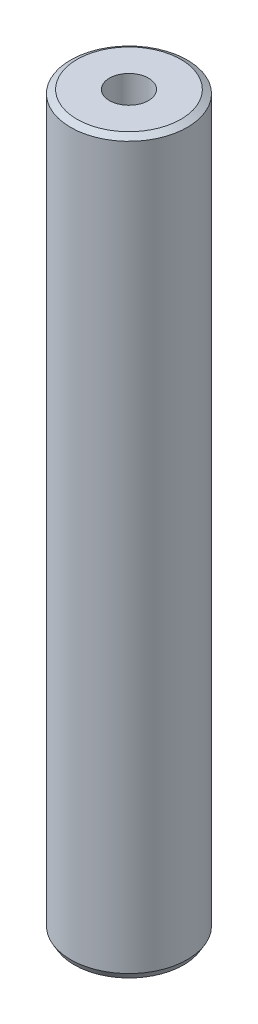
ISO-10303-21;
HEADER;
FILE_DESCRIPTION(('STEP AP214'),'2;1');
FILE_NAME('part.step','',(''),(''),'','','');
FILE_SCHEMA(('AUTOMOTIVE_DESIGN { 1 0 10303 214 1 1 1 1 }'));
ENDSEC;
DATA;
#1=APPLICATION_CONTEXT('core data for automotive mechanical design processes');
#2=APPLICATION_PROTOCOL_DEFINITION('international standard','automotive_design',2000,#1);
#3=PRODUCT_CONTEXT('',#1,'mechanical');
#4=PRODUCT('Part','Part','',(#3));
#5=PRODUCT_RELATED_PRODUCT_CATEGORY('part','',(#4));
#6=PRODUCT_DEFINITION_FORMATION('','',#4);
#7=PRODUCT_DEFINITION_CONTEXT('part definition',#1,'design');
#8=PRODUCT_DEFINITION('design','',#6,#7);
#9=PRODUCT_DEFINITION_SHAPE('','',#8);
#10=(LENGTH_UNIT() NAMED_UNIT(*) SI_UNIT(.MILLI.,.METRE.));
#11=(NAMED_UNIT(*) PLANE_ANGLE_UNIT() SI_UNIT($,.RADIAN.));
#12=(NAMED_UNIT(*) SI_UNIT($,.STERADIAN.) SOLID_ANGLE_UNIT());
#13=UNCERTAINTY_MEASURE_WITH_UNIT(LENGTH_MEASURE(1.E-05),#10,'distance_accuracy_value','');
#14=(GEOMETRIC_REPRESENTATION_CONTEXT(3) GLOBAL_UNCERTAINTY_ASSIGNED_CONTEXT((#13)) GLOBAL_UNIT_ASSIGNED_CONTEXT((#10,
#11,#12)) REPRESENTATION_CONTEXT('',''));
#15=CARTESIAN_POINT('',(0.,0.,0.));
#16=DIRECTION('',(0.,0.,1.));
#17=DIRECTION('',(1.,0.,0.));
#18=AXIS2_PLACEMENT_3D('',#15,#16,#17);
#19=CARTESIAN_POINT('',(0.,219.123057402879,0.));
#20=DIRECTION('',(0.,-1.,0.));
#21=DIRECTION('',(0.,0.,-1.));
#22=AXIS2_PLACEMENT_3D('',#19,#20,#21);
#23=CYLINDRICAL_SURFACE('',#22,17.5);
#24=CARTESIAN_POINT('',(0.,218.002614538572,0.));
#25=DIRECTION('',(0.,1.,0.));
#26=DIRECTION('',(0.,0.,1.));
#27=AXIS2_PLACEMENT_3D('',#24,#25,#26);
#28=CIRCLE('',#27,17.5);
#29=CARTESIAN_POINT('',(0.,218.002614538572,17.5));
#30=VERTEX_POINT('',#29);
#31=EDGE_CURVE('E50',#30,#30,#28,.F.);
#32=ORIENTED_EDGE('',*,*,#31,.T.);
#33=EDGE_LOOP('',(#32));
#34=FACE_BOUND('',#33,.T.);
#35=CARTESIAN_POINT('',(0.,1.94066396795703,0.));
#36=DIRECTION('',(0.,1.,0.));
#37=DIRECTION('',(0.,0.,1.));
#38=AXIS2_PLACEMENT_3D('',#35,#36,#37);
#39=CIRCLE('',#38,17.5);
#40=CARTESIAN_POINT('',(0.,1.94066396795703,17.5));
#41=VERTEX_POINT('',#40);
#42=EDGE_CURVE('E51',#41,#41,#39,.T.);
#43=ORIENTED_EDGE('',*,*,#42,.T.);
#44=EDGE_LOOP('',(#43));
#45=FACE_BOUND('',#44,.T.);
#46=ADVANCED_FACE('F39',(#34,#45),#23,.T.);
#47=CARTESIAN_POINT('',(0.,219.123057402879,0.));
#48=DIRECTION('',(0.,1.,0.));
#49=DIRECTION('',(0.,0.,1.));
#50=AXIS2_PLACEMENT_3D('',#47,#48,#49);
#51=PLANE('',#50);
#52=CARTESIAN_POINT('',(0.,219.123057402879,0.));
#53=DIRECTION('',(0.,1.,0.));
#54=DIRECTION('',(0.,0.,1.));
#55=AXIS2_PLACEMENT_3D('',#52,#53,#54);
#56=CIRCLE('',#55,15.5593360320429);
#57=CARTESIAN_POINT('',(0.,219.123057402879,15.5593360320429));
#58=VERTEX_POINT('',#57);
#59=EDGE_CURVE('E54',#58,#58,#56,.T.);
#60=ORIENTED_EDGE('',*,*,#59,.T.);
#61=EDGE_LOOP('',(#60));
#62=FACE_BOUND('',#61,.T.);
#63=CARTESIAN_POINT('',(0.,219.123057402879,0.));
#64=DIRECTION('',(0.,1.,0.));
#65=DIRECTION('',(0.,0.,1.));
#66=AXIS2_PLACEMENT_3D('',#63,#64,#65);
#67=CIRCLE('',#66,5.8514270263607);
#68=CARTESIAN_POINT('',(0.,219.123057402879,5.8514270263607));
#69=VERTEX_POINT('',#68);
#70=EDGE_CURVE('E58',#69,#69,#67,.T.);
#71=ORIENTED_EDGE('',*,*,#70,.F.);
#72=EDGE_LOOP('',(#71));
#73=FACE_BOUND('',#72,.T.);
#74=ADVANCED_FACE('F69',(#62,#73),#51,.T.);
#75=CARTESIAN_POINT('',(0.,0.,0.));
#76=DIRECTION('',(0.,1.,0.));
#77=DIRECTION('',(0.,0.,1.));
#78=AXIS2_PLACEMENT_3D('',#75,#76,#77);
#79=PLANE('',#78);
#80=CARTESIAN_POINT('',(0.,0.,0.));
#81=DIRECTION('',(0.,1.,0.));
#82=DIRECTION('',(0.,0.,1.));
#83=AXIS2_PLACEMENT_3D('',#80,#81,#82);
#84=CIRCLE('',#83,16.3795571356934);
#85=CARTESIAN_POINT('',(0.,0.,16.3795571356934));
#86=VERTEX_POINT('',#85);
#87=EDGE_CURVE('E10',#86,#86,#84,.F.);
#88=ORIENTED_EDGE('',*,*,#87,.T.);
#89=EDGE_LOOP('',(#88));
#90=FACE_BOUND('',#89,.T.);
#91=CARTESIAN_POINT('',(0.,0.,0.));
#92=DIRECTION('',(0.,1.,0.));
#93=DIRECTION('',(0.,0.,1.));
#94=AXIS2_PLACEMENT_3D('',#91,#92,#93);
#95=CIRCLE('',#94,5.8514270263607);
#96=CARTESIAN_POINT('',(0.,0.,5.8514270263607));
#97=VERTEX_POINT('',#96);
#98=EDGE_CURVE('E63',#97,#97,#95,.T.);
#99=ORIENTED_EDGE('',*,*,#98,.T.);
#100=EDGE_LOOP('',(#99));
#101=FACE_BOUND('',#100,.T.);
#102=ADVANCED_FACE('F75',(#90,#101),#79,.F.);
#103=CARTESIAN_POINT('',(0.,219.123057402879,0.));
#104=DIRECTION('',(0.,-1.,0.));
#105=DIRECTION('',(0.,0.,-1.));
#106=AXIS2_PLACEMENT_3D('',#103,#104,#105);
#107=CYLINDRICAL_SURFACE('',#106,5.8514270263607);
#108=ORIENTED_EDGE('',*,*,#70,.T.);
#109=EDGE_LOOP('',(#108));
#110=FACE_BOUND('',#109,.T.);
#111=ORIENTED_EDGE('',*,*,#98,.F.);
#112=EDGE_LOOP('',(#111));
#113=FACE_BOUND('',#112,.T.);
#114=ADVANCED_FACE('F70',(#110,#113),#107,.F.);
#115=CARTESIAN_POINT('',(0.,219.123057402879,0.));
#116=DIRECTION('',(0.,-1.,0.));
#117=DIRECTION('',(0.,0.,-1.));
#118=AXIS2_PLACEMENT_3D('',#115,#116,#117);
#119=CONICAL_SURFACE('',#118,15.5593360320429,1.0471975511966);
#120=ORIENTED_EDGE('',*,*,#31,.F.);
#121=EDGE_LOOP('',(#120));
#122=FACE_BOUND('',#121,.T.);
#123=ORIENTED_EDGE('',*,*,#59,.F.);
#124=EDGE_LOOP('',(#123));
#125=FACE_BOUND('',#124,.T.);
#126=ADVANCED_FACE('F81',(#122,#125),#119,.T.);
#127=CARTESIAN_POINT('',(0.,1.94066396795703,0.));
#128=DIRECTION('',(0.,1.,0.));
#129=DIRECTION('',(0.,0.,1.));
#130=AXIS2_PLACEMENT_3D('',#127,#128,#129);
#131=CONICAL_SURFACE('',#130,17.5,0.523598775598305);
#132=ORIENTED_EDGE('',*,*,#87,.F.);
#133=EDGE_LOOP('',(#132));
#134=FACE_BOUND('',#133,.T.);
#135=ORIENTED_EDGE('',*,*,#42,.F.);
#136=EDGE_LOOP('',(#135));
#137=FACE_BOUND('',#136,.T.);
#138=ADVANCED_FACE('F45',(#134,#137),#131,.T.);
#139=CLOSED_SHELL('',(#46,#74,#102,#114,#126,#138));
#140=MANIFOLD_SOLID_BREP('B2',#139);
#141=ADVANCED_BREP_SHAPE_REPRESENTATION('',(#18,#140),#14);
#142=SHAPE_DEFINITION_REPRESENTATION(#9,#141);
ENDSEC;
END-ISO-10303-21;
